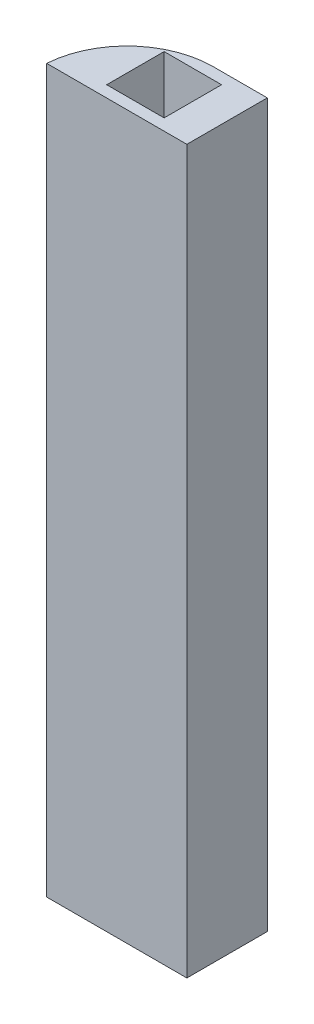
ISO-10303-21;
HEADER;
FILE_DESCRIPTION(('STEP AP214'),'2;1');
FILE_NAME('part.step','',(''),(''),'','','');
FILE_SCHEMA(('AUTOMOTIVE_DESIGN { 1 0 10303 214 1 1 1 1 }'));
ENDSEC;
DATA;
#1=APPLICATION_CONTEXT('core data for automotive mechanical design processes');
#2=APPLICATION_PROTOCOL_DEFINITION('international standard','automotive_design',2000,#1);
#3=PRODUCT_CONTEXT('',#1,'mechanical');
#4=PRODUCT('Part','Part','',(#3));
#5=PRODUCT_RELATED_PRODUCT_CATEGORY('part','',(#4));
#6=PRODUCT_DEFINITION_FORMATION('','',#4);
#7=PRODUCT_DEFINITION_CONTEXT('part definition',#1,'design');
#8=PRODUCT_DEFINITION('design','',#6,#7);
#9=PRODUCT_DEFINITION_SHAPE('','',#8);
#10=(LENGTH_UNIT() NAMED_UNIT(*) SI_UNIT(.MILLI.,.METRE.));
#11=(NAMED_UNIT(*) PLANE_ANGLE_UNIT() SI_UNIT($,.RADIAN.));
#12=(NAMED_UNIT(*) SI_UNIT($,.STERADIAN.) SOLID_ANGLE_UNIT());
#13=UNCERTAINTY_MEASURE_WITH_UNIT(LENGTH_MEASURE(1.E-05),#10,'distance_accuracy_value','');
#14=(GEOMETRIC_REPRESENTATION_CONTEXT(3) GLOBAL_UNCERTAINTY_ASSIGNED_CONTEXT((#13)) GLOBAL_UNIT_ASSIGNED_CONTEXT((#10,
#11,#12)) REPRESENTATION_CONTEXT('',''));
#15=CARTESIAN_POINT('',(0.,0.,0.));
#16=DIRECTION('',(0.,0.,1.));
#17=DIRECTION('',(1.,0.,0.));
#18=AXIS2_PLACEMENT_3D('',#15,#16,#17);
#19=CARTESIAN_POINT('',(12.2,125.7,-7.));
#20=DIRECTION('',(-1.,0.,0.));
#21=DIRECTION('',(0.,0.,1.));
#22=AXIS2_PLACEMENT_3D('',#19,#20,#21);
#23=PLANE('',#22);
#24=DIRECTION('',(0.,0.,-1.));
#25=VECTOR('',#24,1.);
#26=CARTESIAN_POINT('',(12.2,0.,-7.));
#27=LINE('',#26,#25);
#28=CARTESIAN_POINT('',(12.2,0.,7.));
#29=VERTEX_POINT('',#28);
#30=CARTESIAN_POINT('',(12.2,0.,-7.));
#31=VERTEX_POINT('',#30);
#32=EDGE_CURVE('E138',#29,#31,#27,.T.);
#33=ORIENTED_EDGE('',*,*,#32,.T.);
#34=DIRECTION('',(0.,-1.,0.));
#35=VECTOR('',#34,1.);
#36=CARTESIAN_POINT('',(12.2,125.7,-7.));
#37=LINE('',#36,#35);
#38=CARTESIAN_POINT('',(12.2,125.7,-7.));
#39=VERTEX_POINT('',#38);
#40=EDGE_CURVE('E161',#39,#31,#37,.T.);
#41=ORIENTED_EDGE('',*,*,#40,.F.);
#42=DIRECTION('',(0.,0.,-1.));
#43=VECTOR('',#42,1.);
#44=CARTESIAN_POINT('',(12.2,125.7,-7.));
#45=LINE('',#44,#43);
#46=CARTESIAN_POINT('',(12.2,125.7,7.));
#47=VERTEX_POINT('',#46);
#48=EDGE_CURVE('E142',#47,#39,#45,.T.);
#49=ORIENTED_EDGE('',*,*,#48,.F.);
#50=DIRECTION('',(0.,-1.,0.));
#51=VECTOR('',#50,1.);
#52=CARTESIAN_POINT('',(12.2,125.7,7.));
#53=LINE('',#52,#51);
#54=EDGE_CURVE('E150',#47,#29,#53,.T.);
#55=ORIENTED_EDGE('',*,*,#54,.T.);
#56=EDGE_LOOP('',(#33,#41,#49,#55));
#57=FACE_BOUND('',#56,.T.);
#58=ADVANCED_FACE('F35',(#57),#23,.F.);
#59=CARTESIAN_POINT('',(-12.2,125.7,-7.));
#60=DIRECTION('',(0.,0.,1.));
#61=DIRECTION('',(1.,0.,0.));
#62=AXIS2_PLACEMENT_3D('',#59,#60,#61);
#63=PLANE('',#62);
#64=DIRECTION('',(-1.,0.,0.));
#65=VECTOR('',#64,1.);
#66=CARTESIAN_POINT('',(-12.2,0.,-7.));
#67=LINE('',#66,#65);
#68=CARTESIAN_POINT('',(2.76662954709577,0.,-7.));
#69=VERTEX_POINT('',#68);
#70=EDGE_CURVE('E153',#31,#69,#67,.T.);
#71=ORIENTED_EDGE('',*,*,#70,.T.);
#72=DIRECTION('',(0.,1.,0.));
#73=VECTOR('',#72,1.);
#74=CARTESIAN_POINT('',(2.76662954709577,125.7,-7.));
#75=LINE('',#74,#73);
#76=CARTESIAN_POINT('',(2.76662954709577,125.7,-7.));
#77=VERTEX_POINT('',#76);
#78=EDGE_CURVE('E43',#69,#77,#75,.T.);
#79=ORIENTED_EDGE('',*,*,#78,.T.);
#80=DIRECTION('',(-1.,0.,0.));
#81=VECTOR('',#80,1.);
#82=CARTESIAN_POINT('',(-12.2,125.7,-7.));
#83=LINE('',#82,#81);
#84=EDGE_CURVE('E145',#39,#77,#83,.T.);
#85=ORIENTED_EDGE('',*,*,#84,.F.);
#86=ORIENTED_EDGE('',*,*,#40,.T.);
#87=EDGE_LOOP('',(#71,#79,#85,#86));
#88=FACE_BOUND('',#87,.T.);
#89=ADVANCED_FACE('F165',(#88),#63,.F.);
#90=CARTESIAN_POINT('',(-12.2,125.7,7.));
#91=DIRECTION('',(0.,0.,-1.));
#92=DIRECTION('',(-1.,0.,0.));
#93=AXIS2_PLACEMENT_3D('',#90,#91,#92);
#94=PLANE('',#93);
#95=DIRECTION('',(1.,0.,0.));
#96=VECTOR('',#95,1.);
#97=CARTESIAN_POINT('',(-12.2,0.,7.));
#98=LINE('',#97,#96);
#99=CARTESIAN_POINT('',(-12.2,0.,7.));
#100=VERTEX_POINT('',#99);
#101=EDGE_CURVE('E146',#100,#29,#98,.T.);
#102=ORIENTED_EDGE('',*,*,#101,.T.);
#103=ORIENTED_EDGE('',*,*,#54,.F.);
#104=DIRECTION('',(1.,0.,0.));
#105=VECTOR('',#104,1.);
#106=CARTESIAN_POINT('',(-12.2,125.7,7.));
#107=LINE('',#106,#105);
#108=CARTESIAN_POINT('',(-12.2,125.7,7.));
#109=VERTEX_POINT('',#108);
#110=EDGE_CURVE('E148',#109,#47,#107,.T.);
#111=ORIENTED_EDGE('',*,*,#110,.F.);
#112=DIRECTION('',(0.,-1.,0.));
#113=VECTOR('',#112,1.);
#114=CARTESIAN_POINT('',(-12.2,125.7,7.));
#115=LINE('',#114,#113);
#116=EDGE_CURVE('E158',#109,#100,#115,.T.);
#117=ORIENTED_EDGE('',*,*,#116,.T.);
#118=EDGE_LOOP('',(#102,#103,#111,#117));
#119=FACE_BOUND('',#118,.T.);
#120=ADVANCED_FACE('F172',(#119),#94,.F.);
#121=CARTESIAN_POINT('',(0.,125.7,0.));
#122=DIRECTION('',(0.,1.,0.));
#123=DIRECTION('',(0.,0.,1.));
#124=AXIS2_PLACEMENT_3D('',#121,#122,#123);
#125=PLANE('',#124);
#126=DIRECTION('',(1.,0.,0.));
#127=VECTOR('',#126,1.);
#128=CARTESIAN_POINT('',(0.,125.7,-5.));
#129=LINE('',#128,#127);
#130=CARTESIAN_POINT('',(-3.76,125.7,-5.));
#131=VERTEX_POINT('',#130);
#132=CARTESIAN_POINT('',(6.24,125.7,-5.));
#133=VERTEX_POINT('',#132);
#134=EDGE_CURVE('E110',#131,#133,#129,.T.);
#135=ORIENTED_EDGE('',*,*,#134,.T.);
#136=DIRECTION('',(0.,0.,-1.));
#137=VECTOR('',#136,1.);
#138=CARTESIAN_POINT('',(6.24,125.7,0.));
#139=LINE('',#138,#137);
#140=CARTESIAN_POINT('',(6.24,125.7,5.));
#141=VERTEX_POINT('',#140);
#142=EDGE_CURVE('E98',#141,#133,#139,.T.);
#143=ORIENTED_EDGE('',*,*,#142,.F.);
#144=DIRECTION('',(1.,0.,0.));
#145=VECTOR('',#144,1.);
#146=CARTESIAN_POINT('',(0.,125.7,5.));
#147=LINE('',#146,#145);
#148=CARTESIAN_POINT('',(-3.76,125.7,5.));
#149=VERTEX_POINT('',#148);
#150=EDGE_CURVE('E109',#149,#141,#147,.T.);
#151=ORIENTED_EDGE('',*,*,#150,.F.);
#152=DIRECTION('',(0.,0.,-1.));
#153=VECTOR('',#152,1.);
#154=CARTESIAN_POINT('',(-3.76,125.7,0.));
#155=LINE('',#154,#153);
#156=EDGE_CURVE('E118',#149,#131,#155,.T.);
#157=ORIENTED_EDGE('',*,*,#156,.T.);
#158=EDGE_LOOP('',(#135,#143,#151,#157));
#159=FACE_BOUND('',#158,.T.);
#160=ORIENTED_EDGE('',*,*,#84,.T.);
#161=CARTESIAN_POINT('',(2.76662954709577,125.7,8.));
#162=DIRECTION('',(0.,1.,0.));
#163=DIRECTION('',(0.,0.,1.));
#164=AXIS2_PLACEMENT_3D('',#161,#162,#163);
#165=CIRCLE('',#164,15.);
#166=EDGE_CURVE('E11',#77,#109,#165,.T.);
#167=ORIENTED_EDGE('',*,*,#166,.T.);
#168=ORIENTED_EDGE('',*,*,#110,.T.);
#169=ORIENTED_EDGE('',*,*,#48,.T.);
#170=EDGE_LOOP('',(#160,#167,#168,#169));
#171=FACE_BOUND('',#170,.T.);
#172=ADVANCED_FACE('F120',(#159,#171),#125,.T.);
#173=CARTESIAN_POINT('',(0.,0.,0.));
#174=DIRECTION('',(0.,1.,0.));
#175=DIRECTION('',(0.,0.,1.));
#176=AXIS2_PLACEMENT_3D('',#173,#174,#175);
#177=PLANE('',#176);
#178=DIRECTION('',(0.,0.,-1.));
#179=VECTOR('',#178,1.);
#180=CARTESIAN_POINT('',(6.24,0.,0.));
#181=LINE('',#180,#179);
#182=CARTESIAN_POINT('',(6.24,0.,5.));
#183=VERTEX_POINT('',#182);
#184=CARTESIAN_POINT('',(6.24,0.,-5.));
#185=VERTEX_POINT('',#184);
#186=EDGE_CURVE('E132',#183,#185,#181,.T.);
#187=ORIENTED_EDGE('',*,*,#186,.T.);
#188=DIRECTION('',(1.,0.,0.));
#189=VECTOR('',#188,1.);
#190=CARTESIAN_POINT('',(0.,0.,-5.));
#191=LINE('',#190,#189);
#192=CARTESIAN_POINT('',(-3.76,0.,-5.));
#193=VERTEX_POINT('',#192);
#194=EDGE_CURVE('E117',#193,#185,#191,.T.);
#195=ORIENTED_EDGE('',*,*,#194,.F.);
#196=DIRECTION('',(0.,0.,-1.));
#197=VECTOR('',#196,1.);
#198=CARTESIAN_POINT('',(-3.76,0.,0.));
#199=LINE('',#198,#197);
#200=CARTESIAN_POINT('',(-3.76,0.,5.));
#201=VERTEX_POINT('',#200);
#202=EDGE_CURVE('E123',#201,#193,#199,.T.);
#203=ORIENTED_EDGE('',*,*,#202,.F.);
#204=DIRECTION('',(1.,0.,0.));
#205=VECTOR('',#204,1.);
#206=CARTESIAN_POINT('',(0.,0.,5.));
#207=LINE('',#206,#205);
#208=EDGE_CURVE('E126',#201,#183,#207,.T.);
#209=ORIENTED_EDGE('',*,*,#208,.T.);
#210=EDGE_LOOP('',(#187,#195,#203,#209));
#211=FACE_BOUND('',#210,.T.);
#212=ORIENTED_EDGE('',*,*,#101,.F.);
#213=CARTESIAN_POINT('',(2.76662954709577,0.,8.));
#214=DIRECTION('',(0.,1.,0.));
#215=DIRECTION('',(0.,0.,1.));
#216=AXIS2_PLACEMENT_3D('',#213,#214,#215);
#217=CIRCLE('',#216,15.);
#218=EDGE_CURVE('E57',#100,#69,#217,.F.);
#219=ORIENTED_EDGE('',*,*,#218,.T.);
#220=ORIENTED_EDGE('',*,*,#70,.F.);
#221=ORIENTED_EDGE('',*,*,#32,.F.);
#222=EDGE_LOOP('',(#212,#219,#220,#221));
#223=FACE_BOUND('',#222,.T.);
#224=ADVANCED_FACE('F170',(#211,#223),#177,.F.);
#225=CARTESIAN_POINT('',(0.,125.7,-5.));
#226=DIRECTION('',(0.,0.,-1.));
#227=DIRECTION('',(-1.,0.,0.));
#228=AXIS2_PLACEMENT_3D('',#225,#226,#227);
#229=PLANE('',#228);
#230=ORIENTED_EDGE('',*,*,#194,.T.);
#231=DIRECTION('',(0.,-1.,0.));
#232=VECTOR('',#231,1.);
#233=CARTESIAN_POINT('',(6.24,125.7,-5.));
#234=LINE('',#233,#232);
#235=EDGE_CURVE('E102',#133,#185,#234,.T.);
#236=ORIENTED_EDGE('',*,*,#235,.F.);
#237=ORIENTED_EDGE('',*,*,#134,.F.);
#238=DIRECTION('',(0.,-1.,0.));
#239=VECTOR('',#238,1.);
#240=CARTESIAN_POINT('',(-3.76,125.7,-5.));
#241=LINE('',#240,#239);
#242=EDGE_CURVE('E136',#131,#193,#241,.T.);
#243=ORIENTED_EDGE('',*,*,#242,.T.);
#244=EDGE_LOOP('',(#230,#236,#237,#243));
#245=FACE_BOUND('',#244,.T.);
#246=ADVANCED_FACE('F114',(#245),#229,.F.);
#247=CARTESIAN_POINT('',(-3.76,125.7,0.));
#248=DIRECTION('',(-1.,0.,0.));
#249=DIRECTION('',(0.,0.,1.));
#250=AXIS2_PLACEMENT_3D('',#247,#248,#249);
#251=PLANE('',#250);
#252=ORIENTED_EDGE('',*,*,#202,.T.);
#253=ORIENTED_EDGE('',*,*,#242,.F.);
#254=ORIENTED_EDGE('',*,*,#156,.F.);
#255=DIRECTION('',(0.,-1.,0.));
#256=VECTOR('',#255,1.);
#257=CARTESIAN_POINT('',(-3.76,125.7,5.));
#258=LINE('',#257,#256);
#259=EDGE_CURVE('E139',#149,#201,#258,.T.);
#260=ORIENTED_EDGE('',*,*,#259,.T.);
#261=EDGE_LOOP('',(#252,#253,#254,#260));
#262=FACE_BOUND('',#261,.T.);
#263=ADVANCED_FACE('F223',(#262),#251,.F.);
#264=CARTESIAN_POINT('',(0.,125.7,5.));
#265=DIRECTION('',(0.,0.,-1.));
#266=DIRECTION('',(-1.,0.,0.));
#267=AXIS2_PLACEMENT_3D('',#264,#265,#266);
#268=PLANE('',#267);
#269=ORIENTED_EDGE('',*,*,#208,.F.);
#270=ORIENTED_EDGE('',*,*,#259,.F.);
#271=ORIENTED_EDGE('',*,*,#150,.T.);
#272=DIRECTION('',(0.,-1.,0.));
#273=VECTOR('',#272,1.);
#274=CARTESIAN_POINT('',(6.24,125.7,5.));
#275=LINE('',#274,#273);
#276=EDGE_CURVE('E104',#141,#183,#275,.T.);
#277=ORIENTED_EDGE('',*,*,#276,.T.);
#278=EDGE_LOOP('',(#269,#270,#271,#277));
#279=FACE_BOUND('',#278,.T.);
#280=ADVANCED_FACE('F228',(#279),#268,.T.);
#281=CARTESIAN_POINT('',(6.24,125.7,0.));
#282=DIRECTION('',(-1.,0.,0.));
#283=DIRECTION('',(0.,0.,1.));
#284=AXIS2_PLACEMENT_3D('',#281,#282,#283);
#285=PLANE('',#284);
#286=ORIENTED_EDGE('',*,*,#186,.F.);
#287=ORIENTED_EDGE('',*,*,#276,.F.);
#288=ORIENTED_EDGE('',*,*,#142,.T.);
#289=ORIENTED_EDGE('',*,*,#235,.T.);
#290=EDGE_LOOP('',(#286,#287,#288,#289));
#291=FACE_BOUND('',#290,.T.);
#292=ADVANCED_FACE('F101',(#291),#285,.T.);
#293=CARTESIAN_POINT('',(2.76662954709577,125.7,8.));
#294=DIRECTION('',(0.,1.,0.));
#295=DIRECTION('',(0.,0.,1.));
#296=AXIS2_PLACEMENT_3D('',#293,#294,#295);
#297=CYLINDRICAL_SURFACE('',#296,15.);
#298=ORIENTED_EDGE('',*,*,#166,.F.);
#299=ORIENTED_EDGE('',*,*,#78,.F.);
#300=ORIENTED_EDGE('',*,*,#218,.F.);
#301=ORIENTED_EDGE('',*,*,#116,.F.);
#302=EDGE_LOOP('',(#298,#299,#300,#301));
#303=FACE_BOUND('',#302,.T.);
#304=ADVANCED_FACE('F37',(#303),#297,.T.);
#305=CLOSED_SHELL('',(#58,#89,#120,#172,#224,#246,#263,#280,#292,#304));
#306=MANIFOLD_SOLID_BREP('B2',#305);
#307=ADVANCED_BREP_SHAPE_REPRESENTATION('',(#18,#306),#14);
#308=SHAPE_DEFINITION_REPRESENTATION(#9,#307);
ENDSEC;
END-ISO-10303-21;
